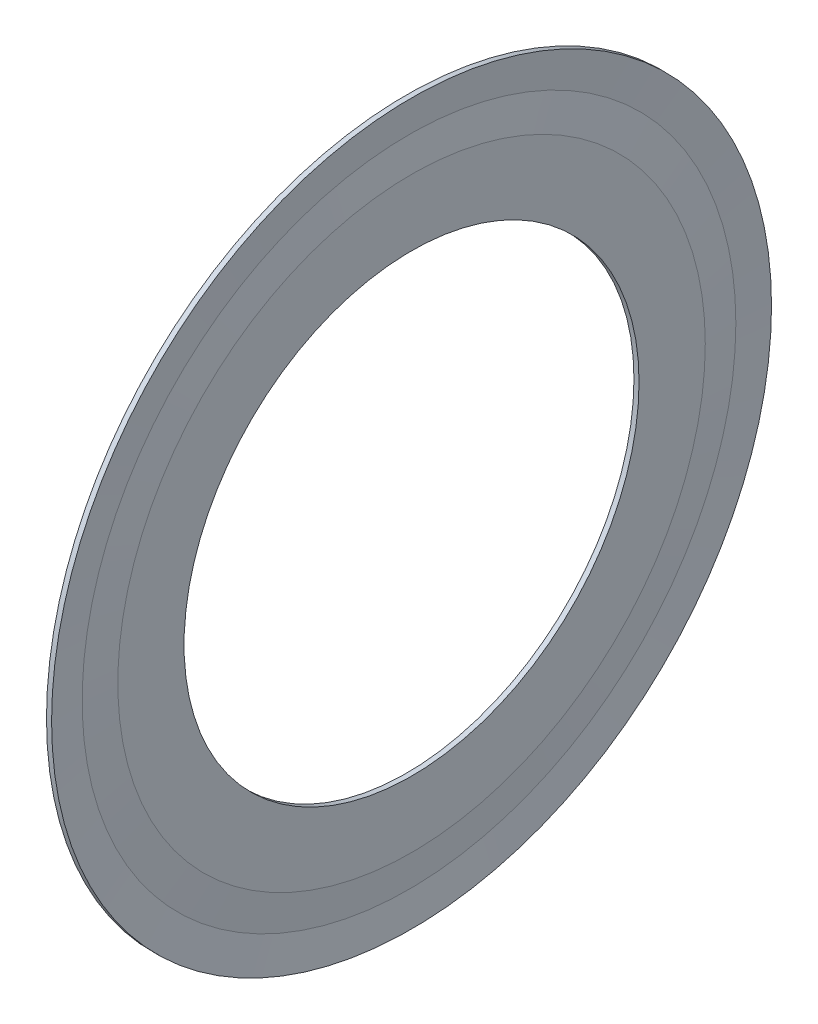
ISO-10303-21;
HEADER;
FILE_DESCRIPTION(('STEP AP214'),'2;1');
FILE_NAME('part.step','',(''),(''),'','','');
FILE_SCHEMA(('AUTOMOTIVE_DESIGN { 1 0 10303 214 1 1 1 1 }'));
ENDSEC;
DATA;
#1=APPLICATION_CONTEXT('core data for automotive mechanical design processes');
#2=APPLICATION_PROTOCOL_DEFINITION('international standard','automotive_design',2000,#1);
#3=PRODUCT_CONTEXT('',#1,'mechanical');
#4=PRODUCT('Part','Part','',(#3));
#5=PRODUCT_RELATED_PRODUCT_CATEGORY('part','',(#4));
#6=PRODUCT_DEFINITION_FORMATION('','',#4);
#7=PRODUCT_DEFINITION_CONTEXT('part definition',#1,'design');
#8=PRODUCT_DEFINITION('design','',#6,#7);
#9=PRODUCT_DEFINITION_SHAPE('','',#8);
#10=(LENGTH_UNIT() NAMED_UNIT(*) SI_UNIT(.MILLI.,.METRE.));
#11=(NAMED_UNIT(*) PLANE_ANGLE_UNIT() SI_UNIT($,.RADIAN.));
#12=(NAMED_UNIT(*) SI_UNIT($,.STERADIAN.) SOLID_ANGLE_UNIT());
#13=UNCERTAINTY_MEASURE_WITH_UNIT(LENGTH_MEASURE(1.E-05),#10,'distance_accuracy_value','');
#14=(GEOMETRIC_REPRESENTATION_CONTEXT(3) GLOBAL_UNCERTAINTY_ASSIGNED_CONTEXT((#13)) GLOBAL_UNIT_ASSIGNED_CONTEXT((#10,
#11,#12)) REPRESENTATION_CONTEXT('',''));
#15=CARTESIAN_POINT('',(0.,0.,0.));
#16=DIRECTION('',(0.,0.,1.));
#17=DIRECTION('',(1.,0.,0.));
#18=AXIS2_PLACEMENT_3D('',#15,#16,#17);
#19=CARTESIAN_POINT('',(13.293,0.,0.));
#20=DIRECTION('',(1.,0.,0.));
#21=DIRECTION('',(0.,0.,-1.));
#22=AXIS2_PLACEMENT_3D('',#19,#20,#21);
#23=CONICAL_SURFACE('',#22,12.5,1.42070735874395);
#24=CARTESIAN_POINT('',(13.116,0.,0.));
#25=DIRECTION('',(1.,0.,0.));
#26=DIRECTION('',(0.,0.,-1.));
#27=AXIS2_PLACEMENT_3D('',#24,#25,#26);
#28=CIRCLE('',#27,11.329568043478);
#29=CARTESIAN_POINT('',(13.116,0.,-11.329568043478));
#30=VERTEX_POINT('',#29);
#31=EDGE_CURVE('E10',#30,#30,#28,.T.);
#32=ORIENTED_EDGE('',*,*,#31,.T.);
#33=EDGE_LOOP('',(#32));
#34=FACE_BOUND('',#33,.T.);
#35=CARTESIAN_POINT('',(13.293,0.,0.));
#36=DIRECTION('',(1.,0.,0.));
#37=DIRECTION('',(0.,0.,-1.));
#38=AXIS2_PLACEMENT_3D('',#35,#36,#37);
#39=CIRCLE('',#38,12.5);
#40=CARTESIAN_POINT('',(13.293,0.,-12.5));
#41=VERTEX_POINT('',#40);
#42=EDGE_CURVE('E57',#41,#41,#39,.T.);
#43=ORIENTED_EDGE('',*,*,#42,.F.);
#44=EDGE_LOOP('',(#43));
#45=FACE_BOUND('',#44,.T.);
#46=ADVANCED_FACE('F29',(#34,#45),#23,.T.);
#47=CARTESIAN_POINT('',(13.116,11.329568043478,0.));
#48=DIRECTION('',(-1.,0.,0.));
#49=DIRECTION('',(0.,0.,1.));
#50=AXIS2_PLACEMENT_3D('',#47,#48,#49);
#51=PLANE('',#50);
#52=CARTESIAN_POINT('',(13.116,0.,0.));
#53=DIRECTION('',(1.,0.,0.));
#54=DIRECTION('',(0.,0.,-1.));
#55=AXIS2_PLACEMENT_3D('',#52,#53,#54);
#56=CIRCLE('',#55,10.2);
#57=CARTESIAN_POINT('',(13.116,0.,-10.2));
#58=VERTEX_POINT('',#57);
#59=EDGE_CURVE('E35',#58,#58,#56,.T.);
#60=ORIENTED_EDGE('',*,*,#59,.T.);
#61=EDGE_LOOP('',(#60));
#62=FACE_BOUND('',#61,.T.);
#63=ORIENTED_EDGE('',*,*,#31,.F.);
#64=EDGE_LOOP('',(#63));
#65=FACE_BOUND('',#64,.T.);
#66=ADVANCED_FACE('F65',(#62,#65),#51,.T.);
#67=CARTESIAN_POINT('',(13.116,0.,0.));
#68=DIRECTION('',(-1.,0.,0.));
#69=DIRECTION('',(0.,0.,1.));
#70=AXIS2_PLACEMENT_3D('',#67,#68,#69);
#71=CONICAL_SURFACE('',#70,10.2,1.49399118752832);
#72=CARTESIAN_POINT('',(13.293,0.,0.));
#73=DIRECTION('',(1.,0.,0.));
#74=DIRECTION('',(0.,0.,-1.));
#75=AXIS2_PLACEMENT_3D('',#72,#73,#74);
#76=CIRCLE('',#75,7.9);
#77=CARTESIAN_POINT('',(13.293,0.,-7.9));
#78=VERTEX_POINT('',#77);
#79=EDGE_CURVE('E39',#78,#78,#76,.T.);
#80=ORIENTED_EDGE('',*,*,#79,.T.);
#81=EDGE_LOOP('',(#80));
#82=FACE_BOUND('',#81,.T.);
#83=ORIENTED_EDGE('',*,*,#59,.F.);
#84=EDGE_LOOP('',(#83));
#85=FACE_BOUND('',#84,.T.);
#86=ADVANCED_FACE('F69',(#82,#85),#71,.F.);
#87=CARTESIAN_POINT('',(50.,0.,0.));
#88=DIRECTION('',(1.,0.,0.));
#89=DIRECTION('',(0.,0.,-1.));
#90=AXIS2_PLACEMENT_3D('',#87,#88,#89);
#91=CYLINDRICAL_SURFACE('',#90,7.9);
#92=CARTESIAN_POINT('',(13.47,0.,0.));
#93=DIRECTION('',(1.,0.,0.));
#94=DIRECTION('',(0.,0.,-1.));
#95=AXIS2_PLACEMENT_3D('',#92,#93,#94);
#96=CIRCLE('',#95,7.9);
#97=CARTESIAN_POINT('',(13.47,0.,-7.9));
#98=VERTEX_POINT('',#97);
#99=EDGE_CURVE('E43',#98,#98,#96,.T.);
#100=ORIENTED_EDGE('',*,*,#99,.T.);
#101=EDGE_LOOP('',(#100));
#102=FACE_BOUND('',#101,.T.);
#103=ORIENTED_EDGE('',*,*,#79,.F.);
#104=EDGE_LOOP('',(#103));
#105=FACE_BOUND('',#104,.T.);
#106=ADVANCED_FACE('F73',(#102,#105),#91,.F.);
#107=CARTESIAN_POINT('',(13.47,7.9,0.));
#108=DIRECTION('',(1.,0.,0.));
#109=DIRECTION('',(0.,0.,-1.));
#110=AXIS2_PLACEMENT_3D('',#107,#108,#109);
#111=PLANE('',#110);
#112=CARTESIAN_POINT('',(13.47,0.,0.));
#113=DIRECTION('',(1.,0.,0.));
#114=DIRECTION('',(0.,0.,-1.));
#115=AXIS2_PLACEMENT_3D('',#112,#113,#114);
#116=CIRCLE('',#115,10.2);
#117=CARTESIAN_POINT('',(13.47,0.,-10.2));
#118=VERTEX_POINT('',#117);
#119=EDGE_CURVE('E48',#118,#118,#116,.T.);
#120=ORIENTED_EDGE('',*,*,#119,.T.);
#121=EDGE_LOOP('',(#120));
#122=FACE_BOUND('',#121,.T.);
#123=ORIENTED_EDGE('',*,*,#99,.F.);
#124=EDGE_LOOP('',(#123));
#125=FACE_BOUND('',#124,.T.);
#126=ADVANCED_FACE('F80',(#122,#125),#111,.T.);
#127=CARTESIAN_POINT('',(13.47,0.,0.));
#128=DIRECTION('',(-1.,0.,0.));
#129=DIRECTION('',(0.,0.,1.));
#130=AXIS2_PLACEMENT_3D('',#127,#128,#129);
#131=CONICAL_SURFACE('',#130,10.2,1.49399118752832);
#132=CARTESIAN_POINT('',(13.3815,0.,0.));
#133=DIRECTION('',(1.,0.,0.));
#134=DIRECTION('',(0.,0.,-1.));
#135=AXIS2_PLACEMENT_3D('',#132,#133,#134);
#136=CIRCLE('',#135,11.35);
#137=CARTESIAN_POINT('',(13.3815,0.,-11.35));
#138=VERTEX_POINT('',#137);
#139=EDGE_CURVE('E51',#138,#138,#136,.T.);
#140=ORIENTED_EDGE('',*,*,#139,.T.);
#141=EDGE_LOOP('',(#140));
#142=FACE_BOUND('',#141,.T.);
#143=ORIENTED_EDGE('',*,*,#119,.F.);
#144=EDGE_LOOP('',(#143));
#145=FACE_BOUND('',#144,.T.);
#146=ADVANCED_FACE('F84',(#142,#145),#131,.T.);
#147=CARTESIAN_POINT('',(13.3815,0.,0.));
#148=DIRECTION('',(1.,0.,0.));
#149=DIRECTION('',(0.,0.,-1.));
#150=AXIS2_PLACEMENT_3D('',#147,#148,#149);
#151=CONICAL_SURFACE('',#150,11.35,1.49399118752832);
#152=CARTESIAN_POINT('',(13.47,0.,0.));
#153=DIRECTION('',(1.,0.,0.));
#154=DIRECTION('',(0.,0.,-1.));
#155=AXIS2_PLACEMENT_3D('',#152,#153,#154);
#156=CIRCLE('',#155,12.5);
#157=CARTESIAN_POINT('',(13.47,0.,-12.5));
#158=VERTEX_POINT('',#157);
#159=EDGE_CURVE('E54',#158,#158,#156,.T.);
#160=ORIENTED_EDGE('',*,*,#159,.T.);
#161=EDGE_LOOP('',(#160));
#162=FACE_BOUND('',#161,.T.);
#163=ORIENTED_EDGE('',*,*,#139,.F.);
#164=EDGE_LOOP('',(#163));
#165=FACE_BOUND('',#164,.T.);
#166=ADVANCED_FACE('F88',(#162,#165),#151,.F.);
#167=CARTESIAN_POINT('',(50.,0.,0.));
#168=DIRECTION('',(1.,0.,0.));
#169=DIRECTION('',(0.,0.,-1.));
#170=AXIS2_PLACEMENT_3D('',#167,#168,#169);
#171=CYLINDRICAL_SURFACE('',#170,12.5);
#172=ORIENTED_EDGE('',*,*,#42,.T.);
#173=EDGE_LOOP('',(#172));
#174=FACE_BOUND('',#173,.T.);
#175=ORIENTED_EDGE('',*,*,#159,.F.);
#176=EDGE_LOOP('',(#175));
#177=FACE_BOUND('',#176,.T.);
#178=ADVANCED_FACE('F61',(#174,#177),#171,.T.);
#179=CLOSED_SHELL('',(#46,#66,#86,#106,#126,#146,#166,#178));
#180=MANIFOLD_SOLID_BREP('B2',#179);
#181=ADVANCED_BREP_SHAPE_REPRESENTATION('',(#18,#180),#14);
#182=SHAPE_DEFINITION_REPRESENTATION(#9,#181);
ENDSEC;
END-ISO-10303-21;
